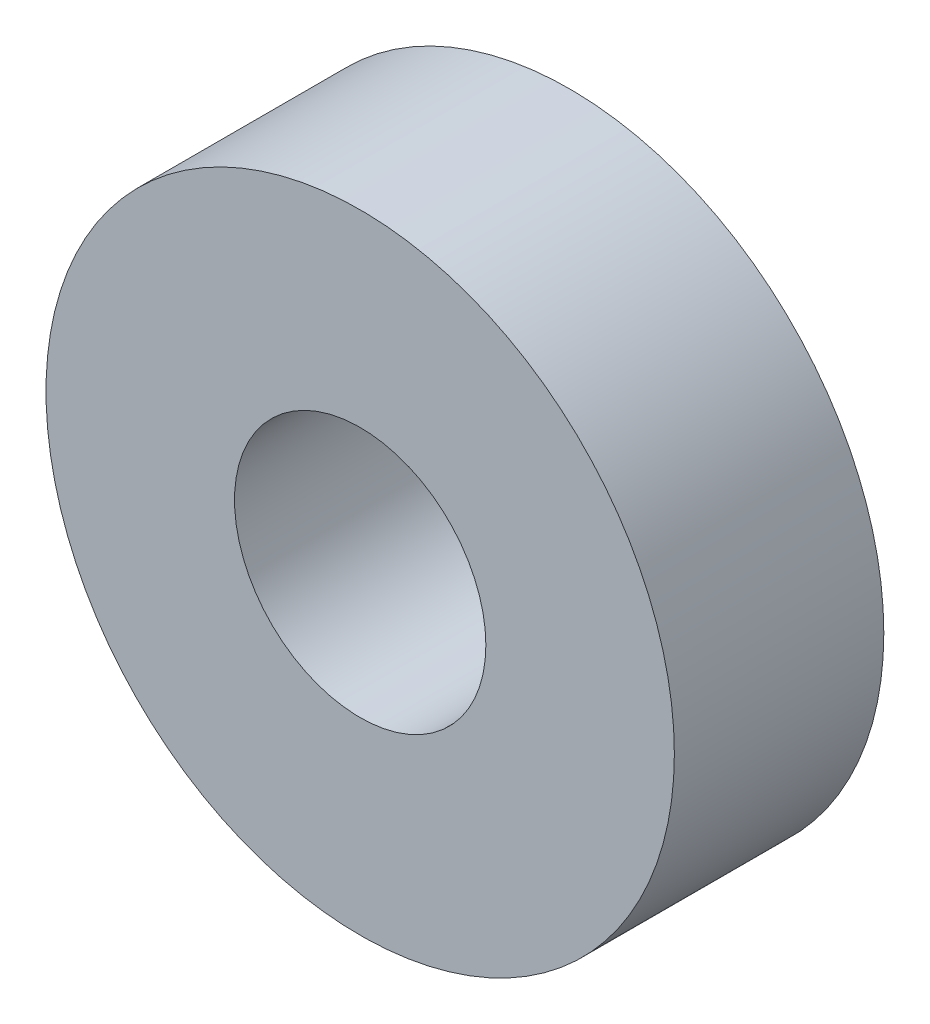
ISO-10303-21;
HEADER;
FILE_DESCRIPTION(('STEP AP214'),'2;1');
FILE_NAME('part.step','',(''),(''),'','','');
FILE_SCHEMA(('AUTOMOTIVE_DESIGN { 1 0 10303 214 1 1 1 1 }'));
ENDSEC;
DATA;
#1=APPLICATION_CONTEXT('core data for automotive mechanical design processes');
#2=APPLICATION_PROTOCOL_DEFINITION('international standard','automotive_design',2000,#1);
#3=PRODUCT_CONTEXT('',#1,'mechanical');
#4=PRODUCT('Part','Part','',(#3));
#5=PRODUCT_RELATED_PRODUCT_CATEGORY('part','',(#4));
#6=PRODUCT_DEFINITION_FORMATION('','',#4);
#7=PRODUCT_DEFINITION_CONTEXT('part definition',#1,'design');
#8=PRODUCT_DEFINITION('design','',#6,#7);
#9=PRODUCT_DEFINITION_SHAPE('','',#8);
#10=(LENGTH_UNIT() NAMED_UNIT(*) SI_UNIT(.MILLI.,.METRE.));
#11=(NAMED_UNIT(*) PLANE_ANGLE_UNIT() SI_UNIT($,.RADIAN.));
#12=(NAMED_UNIT(*) SI_UNIT($,.STERADIAN.) SOLID_ANGLE_UNIT());
#13=UNCERTAINTY_MEASURE_WITH_UNIT(LENGTH_MEASURE(1.E-05),#10,'distance_accuracy_value','');
#14=(GEOMETRIC_REPRESENTATION_CONTEXT(3) GLOBAL_UNCERTAINTY_ASSIGNED_CONTEXT((#13)) GLOBAL_UNIT_ASSIGNED_CONTEXT((#10,
#11,#12)) REPRESENTATION_CONTEXT('',''));
#15=CARTESIAN_POINT('',(0.,0.,0.));
#16=DIRECTION('',(0.,0.,1.));
#17=DIRECTION('',(1.,0.,0.));
#18=AXIS2_PLACEMENT_3D('',#15,#16,#17);
#19=CARTESIAN_POINT('',(0.,0.,5.));
#20=DIRECTION('',(0.,0.,1.));
#21=DIRECTION('',(1.,0.,0.));
#22=AXIS2_PLACEMENT_3D('',#19,#20,#21);
#23=PLANE('',#22);
#24=CARTESIAN_POINT('',(0.,0.,5.));
#25=DIRECTION('',(0.,0.,1.));
#26=DIRECTION('',(1.,0.,0.));
#27=AXIS2_PLACEMENT_3D('',#24,#25,#26);
#28=CIRCLE('',#27,7.5);
#29=CARTESIAN_POINT('',(7.5,0.,5.));
#30=VERTEX_POINT('',#29);
#31=EDGE_CURVE('E10',#30,#30,#28,.T.);
#32=ORIENTED_EDGE('',*,*,#31,.T.);
#33=EDGE_LOOP('',(#32));
#34=FACE_BOUND('',#33,.T.);
#35=CARTESIAN_POINT('',(0.,0.,5.));
#36=DIRECTION('',(0.,0.,1.));
#37=DIRECTION('',(1.,0.,0.));
#38=AXIS2_PLACEMENT_3D('',#35,#36,#37);
#39=CIRCLE('',#38,3.);
#40=CARTESIAN_POINT('',(3.,0.,5.));
#41=VERTEX_POINT('',#40);
#42=EDGE_CURVE('E50',#41,#41,#39,.T.);
#43=ORIENTED_EDGE('',*,*,#42,.F.);
#44=EDGE_LOOP('',(#43));
#45=FACE_BOUND('',#44,.T.);
#46=ADVANCED_FACE('F37',(#34,#45),#23,.T.);
#47=CARTESIAN_POINT('',(0.,0.,0.));
#48=DIRECTION('',(0.,0.,1.));
#49=DIRECTION('',(1.,0.,0.));
#50=AXIS2_PLACEMENT_3D('',#47,#48,#49);
#51=PLANE('',#50);
#52=CARTESIAN_POINT('',(0.,0.,0.));
#53=DIRECTION('',(0.,0.,1.));
#54=DIRECTION('',(1.,0.,0.));
#55=AXIS2_PLACEMENT_3D('',#52,#53,#54);
#56=CIRCLE('',#55,7.5);
#57=CARTESIAN_POINT('',(7.5,0.,0.));
#58=VERTEX_POINT('',#57);
#59=EDGE_CURVE('E41',#58,#58,#56,.T.);
#60=ORIENTED_EDGE('',*,*,#59,.F.);
#61=EDGE_LOOP('',(#60));
#62=FACE_BOUND('',#61,.T.);
#63=CARTESIAN_POINT('',(0.,0.,0.));
#64=DIRECTION('',(0.,0.,1.));
#65=DIRECTION('',(1.,0.,0.));
#66=AXIS2_PLACEMENT_3D('',#63,#64,#65);
#67=CIRCLE('',#66,3.);
#68=CARTESIAN_POINT('',(3.,0.,0.));
#69=VERTEX_POINT('',#68);
#70=EDGE_CURVE('E52',#69,#69,#67,.T.);
#71=ORIENTED_EDGE('',*,*,#70,.T.);
#72=EDGE_LOOP('',(#71));
#73=FACE_BOUND('',#72,.T.);
#74=ADVANCED_FACE('F64',(#62,#73),#51,.F.);
#75=CARTESIAN_POINT('',(0.,0.,5.));
#76=DIRECTION('',(0.,0.,-1.));
#77=DIRECTION('',(-1.,0.,0.));
#78=AXIS2_PLACEMENT_3D('',#75,#76,#77);
#79=CYLINDRICAL_SURFACE('',#78,7.5);
#80=ORIENTED_EDGE('',*,*,#31,.F.);
#81=EDGE_LOOP('',(#80));
#82=FACE_BOUND('',#81,.T.);
#83=ORIENTED_EDGE('',*,*,#59,.T.);
#84=EDGE_LOOP('',(#83));
#85=FACE_BOUND('',#84,.T.);
#86=ADVANCED_FACE('F39',(#82,#85),#79,.T.);
#87=CARTESIAN_POINT('',(0.,0.,5.));
#88=DIRECTION('',(0.,0.,-1.));
#89=DIRECTION('',(-1.,0.,0.));
#90=AXIS2_PLACEMENT_3D('',#87,#88,#89);
#91=CYLINDRICAL_SURFACE('',#90,3.);
#92=ORIENTED_EDGE('',*,*,#42,.T.);
#93=EDGE_LOOP('',(#92));
#94=FACE_BOUND('',#93,.T.);
#95=ORIENTED_EDGE('',*,*,#70,.F.);
#96=EDGE_LOOP('',(#95));
#97=FACE_BOUND('',#96,.T.);
#98=ADVANCED_FACE('F60',(#94,#97),#91,.F.);
#99=CLOSED_SHELL('',(#46,#74,#86,#98));
#100=MANIFOLD_SOLID_BREP('B2',#99);
#101=ADVANCED_BREP_SHAPE_REPRESENTATION('',(#18,#100),#14);
#102=SHAPE_DEFINITION_REPRESENTATION(#9,#101);
ENDSEC;
END-ISO-10303-21;
